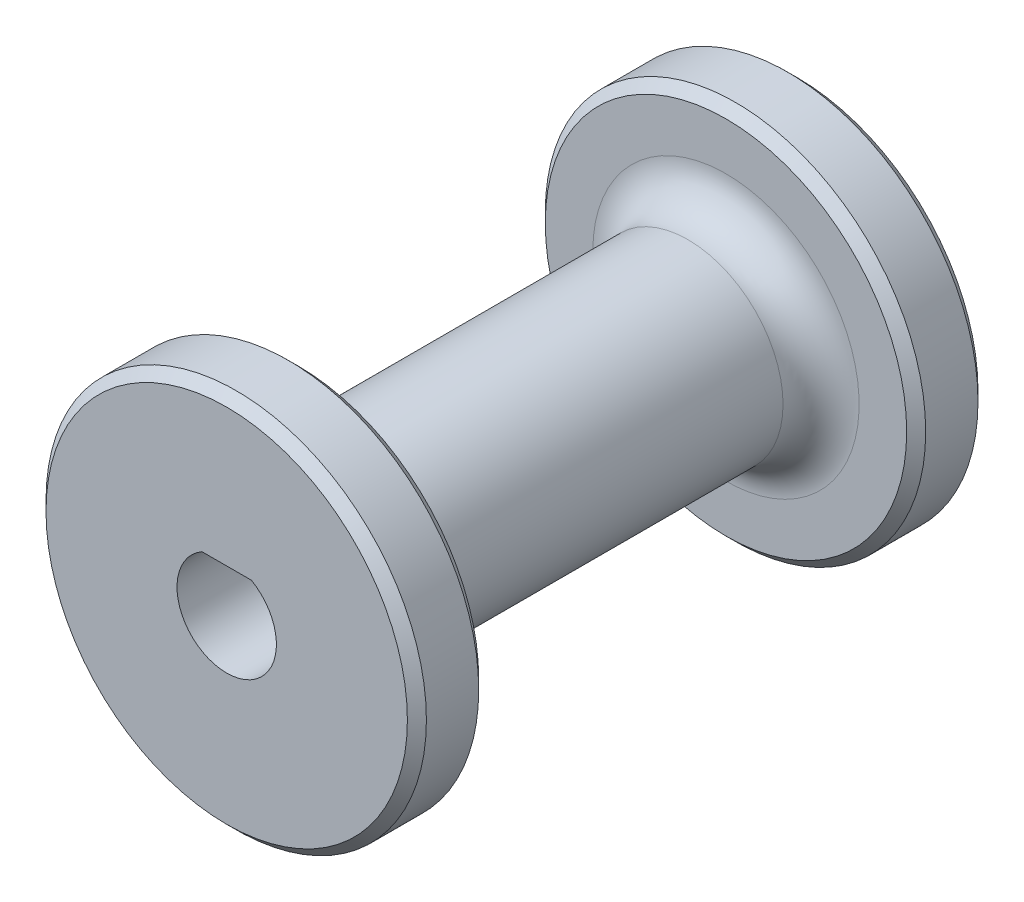
ISO-10303-21;
HEADER;
FILE_DESCRIPTION(('STEP AP214'),'2;1');
FILE_NAME('part.step','',(''),(''),'','','');
FILE_SCHEMA(('AUTOMOTIVE_DESIGN { 1 0 10303 214 1 1 1 1 }'));
ENDSEC;
DATA;
#1=APPLICATION_CONTEXT('core data for automotive mechanical design processes');
#2=APPLICATION_PROTOCOL_DEFINITION('international standard','automotive_design',2000,#1);
#3=PRODUCT_CONTEXT('',#1,'mechanical');
#4=PRODUCT('Part','Part','',(#3));
#5=PRODUCT_RELATED_PRODUCT_CATEGORY('part','',(#4));
#6=PRODUCT_DEFINITION_FORMATION('','',#4);
#7=PRODUCT_DEFINITION_CONTEXT('part definition',#1,'design');
#8=PRODUCT_DEFINITION('design','',#6,#7);
#9=PRODUCT_DEFINITION_SHAPE('','',#8);
#10=(LENGTH_UNIT() NAMED_UNIT(*) SI_UNIT(.MILLI.,.METRE.));
#11=(NAMED_UNIT(*) PLANE_ANGLE_UNIT() SI_UNIT($,.RADIAN.));
#12=(NAMED_UNIT(*) SI_UNIT($,.STERADIAN.) SOLID_ANGLE_UNIT());
#13=UNCERTAINTY_MEASURE_WITH_UNIT(LENGTH_MEASURE(1.E-05),#10,'distance_accuracy_value','');
#14=(GEOMETRIC_REPRESENTATION_CONTEXT(3) GLOBAL_UNCERTAINTY_ASSIGNED_CONTEXT((#13)) GLOBAL_UNIT_ASSIGNED_CONTEXT((#10,
#11,#12)) REPRESENTATION_CONTEXT('',''));
#15=CARTESIAN_POINT('',(0.,0.,0.));
#16=DIRECTION('',(0.,0.,1.));
#17=DIRECTION('',(1.,0.,0.));
#18=AXIS2_PLACEMENT_3D('',#15,#16,#17);
#19=CARTESIAN_POINT('',(0.,0.,-14.2875));
#20=DIRECTION('',(0.,0.,1.));
#21=DIRECTION('',(1.,0.,0.));
#22=AXIS2_PLACEMENT_3D('',#19,#20,#21);
#23=CYLINDRICAL_SURFACE('',#22,3.317499969);
#24=CARTESIAN_POINT('',(0.,0.,19.05));
#25=DIRECTION('',(0.,0.,-1.));
#26=DIRECTION('',(-1.,0.,0.));
#27=AXIS2_PLACEMENT_3D('',#24,#25,#26);
#28=CIRCLE('',#27,3.317499969);
#29=CARTESIAN_POINT('',(-1.651,2.87749979049782,19.05));
#30=VERTEX_POINT('',#29);
#31=CARTESIAN_POINT('',(1.651,2.87749979049782,19.05));
#32=VERTEX_POINT('',#31);
#33=EDGE_CURVE('E71',#30,#32,#28,.F.);
#34=ORIENTED_EDGE('',*,*,#33,.T.);
#35=DIRECTION('',(0.,0.,1.));
#36=VECTOR('',#35,1.);
#37=CARTESIAN_POINT('',(1.651,2.87749979049782,-19.052));
#38=LINE('',#37,#36);
#39=CARTESIAN_POINT('',(1.651,2.87749979049782,5.08));
#40=VERTEX_POINT('',#39);
#41=EDGE_CURVE('E62',#40,#32,#38,.T.);
#42=ORIENTED_EDGE('',*,*,#41,.F.);
#43=CARTESIAN_POINT('',(0.,0.,5.08));
#44=DIRECTION('',(0.,0.,-1.));
#45=DIRECTION('',(-1.,0.,0.));
#46=AXIS2_PLACEMENT_3D('',#43,#44,#45);
#47=CIRCLE('',#46,3.317499969);
#48=CARTESIAN_POINT('',(-1.651,2.87749979049782,5.08));
#49=VERTEX_POINT('',#48);
#50=EDGE_CURVE('E69',#49,#40,#47,.F.);
#51=ORIENTED_EDGE('',*,*,#50,.F.);
#52=DIRECTION('',(0.,0.,1.));
#53=VECTOR('',#52,1.);
#54=CARTESIAN_POINT('',(-1.651,2.87749979049782,-19.052));
#55=LINE('',#54,#53);
#56=EDGE_CURVE('E50',#49,#30,#55,.T.);
#57=ORIENTED_EDGE('',*,*,#56,.T.);
#58=EDGE_LOOP('',(#34,#42,#51,#57));
#59=FACE_BOUND('',#58,.T.);
#60=ADVANCED_FACE('F35',(#59),#23,.F.);
#61=CARTESIAN_POINT('',(0.,0.,-14.2875));
#62=DIRECTION('',(0.,0.,1.));
#63=DIRECTION('',(1.,0.,0.));
#64=AXIS2_PLACEMENT_3D('',#61,#62,#63);
#65=CYLINDRICAL_SURFACE('',#64,6.35);
#66=CARTESIAN_POINT('',(0.,0.,11.7475));
#67=DIRECTION('',(0.,0.,1.));
#68=DIRECTION('',(1.,0.,0.));
#69=AXIS2_PLACEMENT_3D('',#66,#67,#68);
#70=CIRCLE('',#69,6.35);
#71=CARTESIAN_POINT('',(6.35,0.,11.7475));
#72=VERTEX_POINT('',#71);
#73=EDGE_CURVE('E83',#72,#72,#70,.F.);
#74=ORIENTED_EDGE('',*,*,#73,.T.);
#75=EDGE_LOOP('',(#74));
#76=FACE_BOUND('',#75,.T.);
#77=CARTESIAN_POINT('',(0.,0.,-11.7475));
#78=DIRECTION('',(0.,0.,-1.));
#79=DIRECTION('',(-1.,0.,0.));
#80=AXIS2_PLACEMENT_3D('',#77,#78,#79);
#81=CIRCLE('',#80,6.35);
#82=CARTESIAN_POINT('',(-6.35,0.,-11.7475));
#83=VERTEX_POINT('',#82);
#84=EDGE_CURVE('E77',#83,#83,#81,.F.);
#85=ORIENTED_EDGE('',*,*,#84,.T.);
#86=EDGE_LOOP('',(#85));
#87=FACE_BOUND('',#86,.T.);
#88=ADVANCED_FACE('F141',(#76,#87),#65,.T.);
#89=CARTESIAN_POINT('',(0.,0.,-19.05));
#90=DIRECTION('',(0.,0.,1.));
#91=DIRECTION('',(1.,0.,0.));
#92=AXIS2_PLACEMENT_3D('',#89,#90,#91);
#93=CYLINDRICAL_SURFACE('',#92,12.7);
#94=CARTESIAN_POINT('',(0.,0.,-18.415));
#95=DIRECTION('',(0.,0.,-1.));
#96=DIRECTION('',(-1.,0.,0.));
#97=AXIS2_PLACEMENT_3D('',#94,#95,#96);
#98=CIRCLE('',#97,12.7);
#99=CARTESIAN_POINT('',(12.7,0.,-18.415));
#100=VERTEX_POINT('',#99);
#101=EDGE_CURVE('E95',#100,#100,#98,.F.);
#102=CARTESIAN_POINT('',(0.,0.,-14.9225));
#103=DIRECTION('',(0.,0.,-1.));
#104=DIRECTION('',(-1.,0.,0.));
#105=AXIS2_PLACEMENT_3D('',#102,#103,#104);
#106=CIRCLE('',#105,12.7);
#107=CARTESIAN_POINT('',(12.7,0.,-14.9225));
#108=VERTEX_POINT('',#107);
#109=EDGE_CURVE('E92',#108,#108,#106,.T.);
#110=CARTESIAN_POINT('',(12.7,0.,-18.415));
#111=CARTESIAN_POINT('',(12.7,0.,-18.3786197916667));
#112=CARTESIAN_POINT('',(12.7,0.,-18.3422395833334));
#113=CARTESIAN_POINT('',(12.7,0.,-18.2694791666667));
#114=CARTESIAN_POINT('',(12.7,0.,-18.2330989583334));
#115=CARTESIAN_POINT('',(12.7,0.,-18.1603385416667));
#116=CARTESIAN_POINT('',(12.7,0.,-18.1239583333334));
#117=CARTESIAN_POINT('',(12.7,0.,-18.0511979166667));
#118=CARTESIAN_POINT('',(12.7,0.,-18.0148177083334));
#119=CARTESIAN_POINT('',(12.7,0.,-17.9420572916667));
#120=CARTESIAN_POINT('',(12.7,0.,-17.9056770833334));
#121=CARTESIAN_POINT('',(12.7,0.,-17.8329166666667));
#122=CARTESIAN_POINT('',(12.7,0.,-17.7965364583334));
#123=CARTESIAN_POINT('',(12.7,0.,-17.7237760416667));
#124=CARTESIAN_POINT('',(12.7,0.,-17.6873958333334));
#125=CARTESIAN_POINT('',(12.7,0.,-17.6146354166667));
#126=CARTESIAN_POINT('',(12.7,0.,-17.5782552083334));
#127=CARTESIAN_POINT('',(12.7,0.,-17.5054947916667));
#128=CARTESIAN_POINT('',(12.7,0.,-17.4691145833334));
#129=CARTESIAN_POINT('',(12.7,0.,-17.3963541666667));
#130=CARTESIAN_POINT('',(12.7,0.,-17.3599739583334));
#131=CARTESIAN_POINT('',(12.7,0.,-17.2872135416667));
#132=CARTESIAN_POINT('',(12.7,0.,-17.2508333333334));
#133=CARTESIAN_POINT('',(12.7,0.,-17.1780729166667));
#134=CARTESIAN_POINT('',(12.7,0.,-17.1416927083334));
#135=CARTESIAN_POINT('',(12.7,0.,-17.0689322916667));
#136=CARTESIAN_POINT('',(12.7,0.,-17.0325520833334));
#137=CARTESIAN_POINT('',(12.7,0.,-16.9597916666667));
#138=CARTESIAN_POINT('',(12.7,0.,-16.9234114583334));
#139=CARTESIAN_POINT('',(12.7,0.,-16.8506510416667));
#140=CARTESIAN_POINT('',(12.7,0.,-16.8142708333334));
#141=CARTESIAN_POINT('',(12.7,0.,-16.7415104166667));
#142=CARTESIAN_POINT('',(12.7,0.,-16.7051302083334));
#143=CARTESIAN_POINT('',(12.7,0.,-16.6323697916667));
#144=CARTESIAN_POINT('',(12.7,0.,-16.5959895833334));
#145=CARTESIAN_POINT('',(12.7,0.,-16.5232291666667));
#146=CARTESIAN_POINT('',(12.7,0.,-16.4868489583334));
#147=CARTESIAN_POINT('',(12.7,0.,-16.4140885416667));
#148=CARTESIAN_POINT('',(12.7,0.,-16.3777083333334));
#149=CARTESIAN_POINT('',(12.7,0.,-16.3049479166667));
#150=CARTESIAN_POINT('',(12.7,0.,-16.2685677083334));
#151=CARTESIAN_POINT('',(12.7,0.,-16.1958072916667));
#152=CARTESIAN_POINT('',(12.7,0.,-16.1594270833334));
#153=CARTESIAN_POINT('',(12.7,0.,-16.0866666666667));
#154=CARTESIAN_POINT('',(12.7,0.,-16.0502864583334));
#155=CARTESIAN_POINT('',(12.7,0.,-15.9775260416667));
#156=CARTESIAN_POINT('',(12.7,0.,-15.9411458333334));
#157=CARTESIAN_POINT('',(12.7,0.,-15.8683854166667));
#158=CARTESIAN_POINT('',(12.7,0.,-15.8320052083334));
#159=CARTESIAN_POINT('',(12.7,0.,-15.7592447916667));
#160=CARTESIAN_POINT('',(12.7,0.,-15.7228645833334));
#161=CARTESIAN_POINT('',(12.7,0.,-15.6501041666667));
#162=CARTESIAN_POINT('',(12.7,0.,-15.6137239583334));
#163=CARTESIAN_POINT('',(12.7,0.,-15.5409635416667));
#164=CARTESIAN_POINT('',(12.7,0.,-15.5045833333334));
#165=CARTESIAN_POINT('',(12.7,0.,-15.4318229166667));
#166=CARTESIAN_POINT('',(12.7,0.,-15.3954427083334));
#167=CARTESIAN_POINT('',(12.7,0.,-15.3226822916667));
#168=CARTESIAN_POINT('',(12.7,0.,-15.2863020833334));
#169=CARTESIAN_POINT('',(12.7,0.,-15.2135416666667));
#170=CARTESIAN_POINT('',(12.7,0.,-15.1771614583334));
#171=CARTESIAN_POINT('',(12.7,0.,-15.1044010416667));
#172=CARTESIAN_POINT('',(12.7,0.,-15.0680208333334));
#173=CARTESIAN_POINT('',(12.7,0.,-14.9952604166667));
#174=CARTESIAN_POINT('',(12.7,0.,-14.9588802083334));
#175=CARTESIAN_POINT('',(12.7,0.,-14.9225));
#176=B_SPLINE_CURVE_WITH_KNOTS('',3,(#110,#111,#112,#113,#114,#115,#116,#117,#118,#119,#120,
#121,#122,#123,#124,#125,#126,#127,#128,#129,#130,#131,#132,#133,#134,#135,#136,#137,#138,#139,
#140,#141,#142,#143,#144,#145,#146,#147,#148,#149,#150,#151,#152,#153,#154,#155,#156,#157,#158,
#159,#160,#161,#162,#163,#164,#165,#166,#167,#168,#169,#170,#171,#172,#173,#174,#175),
.UNSPECIFIED.,.F.,.F.,(4,2,2,2,2,2,2,2,2,2,2,2,2,2,2,2,2,2,2,2,2,2,2,2,2,2,2,2,2,2,2,2,4),(0.,
0.109140625,0.218281250000004,0.327421875000004,0.436562500000005,0.545703125000005,
0.654843750000005,0.763984375000005,0.873125000000006,0.982265625000006,1.09140625000001,
1.20054687500001,1.30968750000001,1.41882812500001,1.52796875000001,1.63710937500001,
1.74625000000001,1.85539062500001,1.96453125000001,2.07367187500001,2.18281250000001,
2.29195312500001,2.40109375000001,2.51023437500001,2.61937500000001,2.72851562500001,
2.83765625000001,2.94679687500001,3.05593750000001,3.16507812500001,3.27421875000001,
3.38335937500001,3.49250000000001),.UNSPECIFIED.);
#177=EDGE_CURVE('BSEAM145',#100,#108,#176,.T.);
#178=ORIENTED_EDGE('',*,*,#101,.T.);
#179=ORIENTED_EDGE('',*,*,#109,.T.);
#180=ORIENTED_EDGE('',*,*,#177,.T.);
#181=ORIENTED_EDGE('',*,*,#177,.F.);
#182=EDGE_LOOP('',(#178,#180,#179,#181));
#183=FACE_BOUND('',#182,.T.);
#184=ADVANCED_FACE('F145',(#183),#93,.T.);
#185=CARTESIAN_POINT('',(0.,0.,-19.05));
#186=DIRECTION('',(0.,0.,-1.));
#187=DIRECTION('',(-1.,0.,0.));
#188=AXIS2_PLACEMENT_3D('',#185,#186,#187);
#189=PLANE('',#188);
#190=CARTESIAN_POINT('',(0.,0.,-19.05));
#191=DIRECTION('',(0.,0.,-1.));
#192=DIRECTION('',(-1.,0.,0.));
#193=AXIS2_PLACEMENT_3D('',#190,#191,#192);
#194=CIRCLE('',#193,12.065);
#195=CARTESIAN_POINT('',(-12.065,0.,-19.05));
#196=VERTEX_POINT('',#195);
#197=EDGE_CURVE('E89',#196,#196,#194,.T.);
#198=ORIENTED_EDGE('',*,*,#197,.T.);
#199=EDGE_LOOP('',(#198));
#200=FACE_BOUND('',#199,.T.);
#201=ADVANCED_FACE('F151',(#200),#189,.T.);
#202=CARTESIAN_POINT('',(0.,0.,-14.2875));
#203=DIRECTION('',(0.,0.,-1.));
#204=DIRECTION('',(-1.,0.,0.));
#205=AXIS2_PLACEMENT_3D('',#202,#203,#204);
#206=PLANE('',#205);
#207=CARTESIAN_POINT('',(0.,0.,-14.2875));
#208=DIRECTION('',(0.,0.,-1.));
#209=DIRECTION('',(-1.,0.,0.));
#210=AXIS2_PLACEMENT_3D('',#207,#208,#209);
#211=CIRCLE('',#210,12.065);
#212=CARTESIAN_POINT('',(-12.065,0.,-14.2875));
#213=VERTEX_POINT('',#212);
#214=EDGE_CURVE('E98',#213,#213,#211,.F.);
#215=ORIENTED_EDGE('',*,*,#214,.T.);
#216=EDGE_LOOP('',(#215));
#217=FACE_BOUND('',#216,.T.);
#218=CARTESIAN_POINT('',(0.,0.,-14.2875));
#219=DIRECTION('',(0.,0.,-1.));
#220=DIRECTION('',(-1.,0.,0.));
#221=AXIS2_PLACEMENT_3D('',#218,#219,#220);
#222=CIRCLE('',#221,8.89);
#223=CARTESIAN_POINT('',(-8.89,0.,-14.2875));
#224=VERTEX_POINT('',#223);
#225=EDGE_CURVE('E86',#224,#224,#222,.T.);
#226=ORIENTED_EDGE('',*,*,#225,.T.);
#227=EDGE_LOOP('',(#226));
#228=FACE_BOUND('',#227,.T.);
#229=ADVANCED_FACE('F153',(#217,#228),#206,.F.);
#230=CARTESIAN_POINT('',(0.,0.,19.05));
#231=DIRECTION('',(0.,0.,-1.));
#232=DIRECTION('',(-1.,0.,0.));
#233=AXIS2_PLACEMENT_3D('',#230,#231,#232);
#234=CYLINDRICAL_SURFACE('',#233,12.7);
#235=CARTESIAN_POINT('',(0.,0.,14.9225));
#236=DIRECTION('',(0.,0.,1.));
#237=DIRECTION('',(1.,0.,0.));
#238=AXIS2_PLACEMENT_3D('',#235,#236,#237);
#239=CIRCLE('',#238,12.7);
#240=CARTESIAN_POINT('',(-12.7,0.,14.9225));
#241=VERTEX_POINT('',#240);
#242=EDGE_CURVE('E43',#241,#241,#239,.T.);
#243=CARTESIAN_POINT('',(0.,0.,18.415));
#244=DIRECTION('',(0.,0.,1.));
#245=DIRECTION('',(1.,0.,0.));
#246=AXIS2_PLACEMENT_3D('',#243,#244,#245);
#247=CIRCLE('',#246,12.7);
#248=CARTESIAN_POINT('',(-12.7,0.,18.415));
#249=VERTEX_POINT('',#248);
#250=EDGE_CURVE('E104',#249,#249,#247,.F.);
#251=CARTESIAN_POINT('',(-12.7,0.,14.9225));
#252=CARTESIAN_POINT('',(-12.7,0.,14.9588802083333));
#253=CARTESIAN_POINT('',(-12.7,0.,14.9952604166666));
#254=CARTESIAN_POINT('',(-12.7,0.,15.0680208333333));
#255=CARTESIAN_POINT('',(-12.7,0.,15.1044010416666));
#256=CARTESIAN_POINT('',(-12.7,0.,15.1771614583333));
#257=CARTESIAN_POINT('',(-12.7,0.,15.2135416666666));
#258=CARTESIAN_POINT('',(-12.7,0.,15.2863020833333));
#259=CARTESIAN_POINT('',(-12.7,0.,15.3226822916666));
#260=CARTESIAN_POINT('',(-12.7,0.,15.3954427083333));
#261=CARTESIAN_POINT('',(-12.7,0.,15.4318229166666));
#262=CARTESIAN_POINT('',(-12.7,0.,15.5045833333333));
#263=CARTESIAN_POINT('',(-12.7,0.,15.5409635416666));
#264=CARTESIAN_POINT('',(-12.7,0.,15.6137239583333));
#265=CARTESIAN_POINT('',(-12.7,0.,15.6501041666666));
#266=CARTESIAN_POINT('',(-12.7,0.,15.7228645833333));
#267=CARTESIAN_POINT('',(-12.7,0.,15.7592447916666));
#268=CARTESIAN_POINT('',(-12.7,0.,15.8320052083333));
#269=CARTESIAN_POINT('',(-12.7,0.,15.8683854166666));
#270=CARTESIAN_POINT('',(-12.7,0.,15.9411458333333));
#271=CARTESIAN_POINT('',(-12.7,0.,15.9775260416666));
#272=CARTESIAN_POINT('',(-12.7,0.,16.0502864583333));
#273=CARTESIAN_POINT('',(-12.7,0.,16.0866666666666));
#274=CARTESIAN_POINT('',(-12.7,0.,16.1594270833333));
#275=CARTESIAN_POINT('',(-12.7,0.,16.1958072916666));
#276=CARTESIAN_POINT('',(-12.7,0.,16.2685677083333));
#277=CARTESIAN_POINT('',(-12.7,0.,16.3049479166666));
#278=CARTESIAN_POINT('',(-12.7,0.,16.3777083333333));
#279=CARTESIAN_POINT('',(-12.7,0.,16.4140885416666));
#280=CARTESIAN_POINT('',(-12.7,0.,16.4868489583333));
#281=CARTESIAN_POINT('',(-12.7,0.,16.5232291666666));
#282=CARTESIAN_POINT('',(-12.7,0.,16.5959895833333));
#283=CARTESIAN_POINT('',(-12.7,0.,16.6323697916666));
#284=CARTESIAN_POINT('',(-12.7,0.,16.7051302083333));
#285=CARTESIAN_POINT('',(-12.7,0.,16.7415104166666));
#286=CARTESIAN_POINT('',(-12.7,0.,16.8142708333333));
#287=CARTESIAN_POINT('',(-12.7,0.,16.8506510416666));
#288=CARTESIAN_POINT('',(-12.7,0.,16.9234114583333));
#289=CARTESIAN_POINT('',(-12.7,0.,16.9597916666666));
#290=CARTESIAN_POINT('',(-12.7,0.,17.0325520833333));
#291=CARTESIAN_POINT('',(-12.7,0.,17.0689322916666));
#292=CARTESIAN_POINT('',(-12.7,0.,17.1416927083333));
#293=CARTESIAN_POINT('',(-12.7,0.,17.1780729166666));
#294=CARTESIAN_POINT('',(-12.7,0.,17.2508333333333));
#295=CARTESIAN_POINT('',(-12.7,0.,17.2872135416666));
#296=CARTESIAN_POINT('',(-12.7,0.,17.3599739583333));
#297=CARTESIAN_POINT('',(-12.7,0.,17.3963541666666));
#298=CARTESIAN_POINT('',(-12.7,0.,17.4691145833333));
#299=CARTESIAN_POINT('',(-12.7,0.,17.5054947916666));
#300=CARTESIAN_POINT('',(-12.7,0.,17.5782552083333));
#301=CARTESIAN_POINT('',(-12.7,0.,17.6146354166666));
#302=CARTESIAN_POINT('',(-12.7,0.,17.6873958333333));
#303=CARTESIAN_POINT('',(-12.7,0.,17.7237760416666));
#304=CARTESIAN_POINT('',(-12.7,0.,17.7965364583333));
#305=CARTESIAN_POINT('',(-12.7,0.,17.8329166666666));
#306=CARTESIAN_POINT('',(-12.7,0.,17.9056770833333));
#307=CARTESIAN_POINT('',(-12.7,0.,17.9420572916666));
#308=CARTESIAN_POINT('',(-12.7,0.,18.0148177083333));
#309=CARTESIAN_POINT('',(-12.7,0.,18.0511979166666));
#310=CARTESIAN_POINT('',(-12.7,0.,18.1239583333333));
#311=CARTESIAN_POINT('',(-12.7,0.,18.1603385416666));
#312=CARTESIAN_POINT('',(-12.7,0.,18.2330989583333));
#313=CARTESIAN_POINT('',(-12.7,0.,18.2694791666666));
#314=CARTESIAN_POINT('',(-12.7,0.,18.3422395833333));
#315=CARTESIAN_POINT('',(-12.7,0.,18.3786197916666));
#316=CARTESIAN_POINT('',(-12.7,0.,18.415));
#317=B_SPLINE_CURVE_WITH_KNOTS('',3,(#251,#252,#253,#254,#255,#256,#257,#258,#259,#260,#261,
#262,#263,#264,#265,#266,#267,#268,#269,#270,#271,#272,#273,#274,#275,#276,#277,#278,#279,#280,
#281,#282,#283,#284,#285,#286,#287,#288,#289,#290,#291,#292,#293,#294,#295,#296,#297,#298,#299,
#300,#301,#302,#303,#304,#305,#306,#307,#308,#309,#310,#311,#312,#313,#314,#315,#316),
.UNSPECIFIED.,.F.,.F.,(4,2,2,2,2,2,2,2,2,2,2,2,2,2,2,2,2,2,2,2,2,2,2,2,2,2,2,2,2,2,2,2,4),(0.,
0.109140625,0.218281250000001,0.327421874999999,0.436562499999999,0.545703125,0.65484375,
0.763984374999999,0.873124999999999,0.982265624999999,1.09140625,1.200546875,1.3096875,
1.418828125,1.52796875,1.637109375,1.74625,1.855390625,1.96453125,2.073671875,2.1828125,
2.291953125,2.40109375,2.510234375,2.619375,2.728515625,2.83765625,2.946796875,3.0559375,
3.16507812500001,3.27421875000001,3.38335937500001,3.49250000000001),.UNSPECIFIED.);
#318=EDGE_CURVE('BSEAM109',#241,#249,#317,.T.);
#319=ORIENTED_EDGE('',*,*,#242,.T.);
#320=ORIENTED_EDGE('',*,*,#250,.T.);
#321=ORIENTED_EDGE('',*,*,#318,.T.);
#322=ORIENTED_EDGE('',*,*,#318,.F.);
#323=EDGE_LOOP('',(#319,#321,#320,#322));
#324=FACE_BOUND('',#323,.T.);
#325=ADVANCED_FACE('F109',(#324),#234,.T.);
#326=CARTESIAN_POINT('',(0.,0.,19.05));
#327=DIRECTION('',(0.,0.,1.));
#328=DIRECTION('',(-1.,0.,0.));
#329=AXIS2_PLACEMENT_3D('',#326,#327,#328);
#330=PLANE('',#329);
#331=CARTESIAN_POINT('',(0.,0.,19.05));
#332=DIRECTION('',(0.,0.,1.));
#333=DIRECTION('',(1.,0.,0.));
#334=AXIS2_PLACEMENT_3D('',#331,#332,#333);
#335=CIRCLE('',#334,12.065);
#336=CARTESIAN_POINT('',(12.065,0.,19.05));
#337=VERTEX_POINT('',#336);
#338=EDGE_CURVE('E11',#337,#337,#335,.T.);
#339=ORIENTED_EDGE('',*,*,#338,.T.);
#340=EDGE_LOOP('',(#339));
#341=FACE_BOUND('',#340,.T.);
#342=ORIENTED_EDGE('',*,*,#33,.F.);
#343=DIRECTION('',(1.,0.,0.));
#344=VECTOR('',#343,1.);
#345=CARTESIAN_POINT('',(0.,2.87749979049782,19.05));
#346=LINE('',#345,#344);
#347=EDGE_CURVE('E55',#30,#32,#346,.T.);
#348=ORIENTED_EDGE('',*,*,#347,.T.);
#349=EDGE_LOOP('',(#342,#348));
#350=FACE_BOUND('',#349,.T.);
#351=ADVANCED_FACE('F121',(#341,#350),#330,.T.);
#352=CARTESIAN_POINT('',(0.,0.,14.2875));
#353=DIRECTION('',(0.,0.,1.));
#354=DIRECTION('',(-1.,0.,0.));
#355=AXIS2_PLACEMENT_3D('',#352,#353,#354);
#356=PLANE('',#355);
#357=CARTESIAN_POINT('',(0.,0.,14.2875));
#358=DIRECTION('',(0.,0.,1.));
#359=DIRECTION('',(1.,0.,0.));
#360=AXIS2_PLACEMENT_3D('',#357,#358,#359);
#361=CIRCLE('',#360,12.065);
#362=CARTESIAN_POINT('',(12.065,0.,14.2875));
#363=VERTEX_POINT('',#362);
#364=EDGE_CURVE('E101',#363,#363,#361,.F.);
#365=ORIENTED_EDGE('',*,*,#364,.T.);
#366=EDGE_LOOP('',(#365));
#367=FACE_BOUND('',#366,.T.);
#368=CARTESIAN_POINT('',(0.,0.,14.2875));
#369=DIRECTION('',(0.,0.,1.));
#370=DIRECTION('',(1.,0.,0.));
#371=AXIS2_PLACEMENT_3D('',#368,#369,#370);
#372=CIRCLE('',#371,8.89);
#373=CARTESIAN_POINT('',(8.89,0.,14.2875));
#374=VERTEX_POINT('',#373);
#375=EDGE_CURVE('E74',#374,#374,#372,.T.);
#376=ORIENTED_EDGE('',*,*,#375,.T.);
#377=EDGE_LOOP('',(#376));
#378=FACE_BOUND('',#377,.T.);
#379=ADVANCED_FACE('F118',(#367,#378),#356,.F.);
#380=CARTESIAN_POINT('',(0.,0.,5.08));
#381=DIRECTION('',(0.,0.,-1.));
#382=DIRECTION('',(-1.,0.,0.));
#383=AXIS2_PLACEMENT_3D('',#380,#381,#382);
#384=PLANE('',#383);
#385=ORIENTED_EDGE('',*,*,#50,.T.);
#386=DIRECTION('',(1.,0.,0.));
#387=VECTOR('',#386,1.);
#388=CARTESIAN_POINT('',(0.,2.87749979049782,5.08));
#389=LINE('',#388,#387);
#390=EDGE_CURVE('E59',#49,#40,#389,.T.);
#391=ORIENTED_EDGE('',*,*,#390,.F.);
#392=EDGE_LOOP('',(#385,#391));
#393=FACE_BOUND('',#392,.T.);
#394=ADVANCED_FACE('F73',(#393),#384,.F.);
#395=CARTESIAN_POINT('',(0.,0.,11.7475));
#396=DIRECTION('',(0.,0.,1.));
#397=DIRECTION('',(1.,0.,0.));
#398=AXIS2_PLACEMENT_3D('',#395,#396,#397);
#399=TOROIDAL_SURFACE('',#398,8.89,2.54);
#400=ORIENTED_EDGE('',*,*,#73,.F.);
#401=EDGE_LOOP('',(#400));
#402=FACE_BOUND('',#401,.T.);
#403=ORIENTED_EDGE('',*,*,#375,.F.);
#404=EDGE_LOOP('',(#403));
#405=FACE_BOUND('',#404,.T.);
#406=ADVANCED_FACE('F125',(#402,#405),#399,.F.);
#407=CARTESIAN_POINT('',(0.,0.,-11.7475));
#408=DIRECTION('',(0.,0.,-1.));
#409=DIRECTION('',(-1.,0.,0.));
#410=AXIS2_PLACEMENT_3D('',#407,#408,#409);
#411=TOROIDAL_SURFACE('',#410,8.89,2.54);
#412=ORIENTED_EDGE('',*,*,#225,.F.);
#413=EDGE_LOOP('',(#412));
#414=FACE_BOUND('',#413,.T.);
#415=ORIENTED_EDGE('',*,*,#84,.F.);
#416=EDGE_LOOP('',(#415));
#417=FACE_BOUND('',#416,.T.);
#418=ADVANCED_FACE('F127',(#414,#417),#411,.F.);
#419=CARTESIAN_POINT('',(0.,0.,-19.05));
#420=DIRECTION('',(0.,0.,1.));
#421=DIRECTION('',(1.,0.,0.));
#422=AXIS2_PLACEMENT_3D('',#419,#420,#421);
#423=CONICAL_SURFACE('',#422,12.065,0.785398163397452);
#424=ORIENTED_EDGE('',*,*,#101,.F.);
#425=EDGE_LOOP('',(#424));
#426=FACE_BOUND('',#425,.T.);
#427=ORIENTED_EDGE('',*,*,#197,.F.);
#428=EDGE_LOOP('',(#427));
#429=FACE_BOUND('',#428,.T.);
#430=ADVANCED_FACE('F134',(#426,#429),#423,.T.);
#431=CARTESIAN_POINT('',(0.,0.,-14.9225));
#432=DIRECTION('',(0.,0.,-1.));
#433=DIRECTION('',(-1.,0.,0.));
#434=AXIS2_PLACEMENT_3D('',#431,#432,#433);
#435=CONICAL_SURFACE('',#434,12.7,0.785398163397451);
#436=ORIENTED_EDGE('',*,*,#214,.F.);
#437=EDGE_LOOP('',(#436));
#438=FACE_BOUND('',#437,.T.);
#439=ORIENTED_EDGE('',*,*,#109,.F.);
#440=EDGE_LOOP('',(#439));
#441=FACE_BOUND('',#440,.T.);
#442=ADVANCED_FACE('F115',(#438,#441),#435,.T.);
#443=CARTESIAN_POINT('',(0.,0.,14.2875));
#444=DIRECTION('',(0.,0.,1.));
#445=DIRECTION('',(1.,0.,0.));
#446=AXIS2_PLACEMENT_3D('',#443,#444,#445);
#447=CONICAL_SURFACE('',#446,12.065,0.785398163397446);
#448=ORIENTED_EDGE('',*,*,#242,.F.);
#449=EDGE_LOOP('',(#448));
#450=FACE_BOUND('',#449,.T.);
#451=ORIENTED_EDGE('',*,*,#364,.F.);
#452=EDGE_LOOP('',(#451));
#453=FACE_BOUND('',#452,.T.);
#454=ADVANCED_FACE('F112',(#450,#453),#447,.T.);
#455=CARTESIAN_POINT('',(0.,0.,18.415));
#456=DIRECTION('',(0.,0.,-1.));
#457=DIRECTION('',(-1.,0.,0.));
#458=AXIS2_PLACEMENT_3D('',#455,#456,#457);
#459=CONICAL_SURFACE('',#458,12.7,0.785398163397457);
#460=ORIENTED_EDGE('',*,*,#338,.F.);
#461=EDGE_LOOP('',(#460));
#462=FACE_BOUND('',#461,.T.);
#463=ORIENTED_EDGE('',*,*,#250,.F.);
#464=EDGE_LOOP('',(#463));
#465=FACE_BOUND('',#464,.T.);
#466=ADVANCED_FACE('F37',(#462,#465),#459,.T.);
#467=CARTESIAN_POINT('',(0.,2.87749979049782,-19.052));
#468=DIRECTION('',(0.,-1.,0.));
#469=DIRECTION('',(0.,0.,-1.));
#470=AXIS2_PLACEMENT_3D('',#467,#468,#469);
#471=PLANE('',#470);
#472=ORIENTED_EDGE('',*,*,#56,.F.);
#473=ORIENTED_EDGE('',*,*,#390,.T.);
#474=ORIENTED_EDGE('',*,*,#41,.T.);
#475=ORIENTED_EDGE('',*,*,#347,.F.);
#476=EDGE_LOOP('',(#472,#473,#474,#475));
#477=FACE_BOUND('',#476,.T.);
#478=ADVANCED_FACE('F61',(#477),#471,.T.);
#479=CLOSED_SHELL('',(#60,#88,#184,#201,#229,#325,#351,#379,#394,#406,#418,#430,#442,#454,#466,#478));
#480=MANIFOLD_SOLID_BREP('B2',#479);
#481=ADVANCED_BREP_SHAPE_REPRESENTATION('',(#18,#480),#14);
#482=SHAPE_DEFINITION_REPRESENTATION(#9,#481);
ENDSEC;
END-ISO-10303-21;
